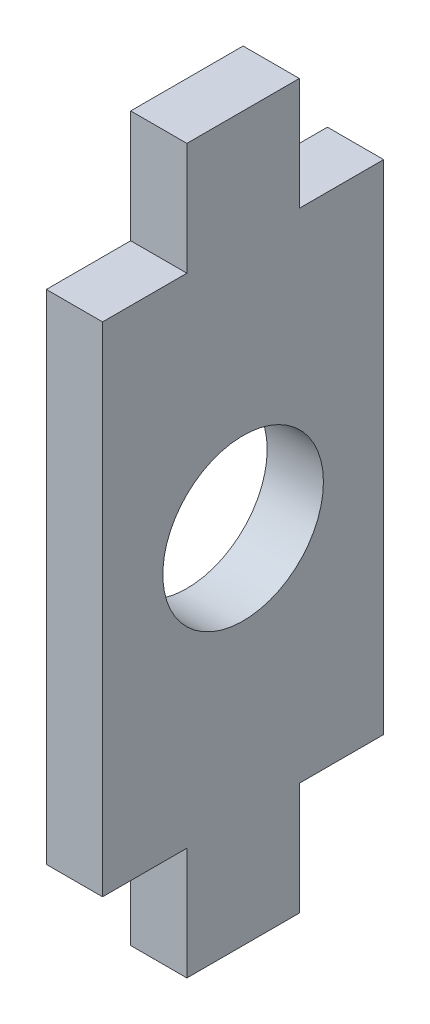
ISO-10303-21;
HEADER;
FILE_DESCRIPTION(('STEP AP214'),'2;1');
FILE_NAME('part.step','',(''),(''),'','','');
FILE_SCHEMA(('AUTOMOTIVE_DESIGN { 1 0 10303 214 1 1 1 1 }'));
ENDSEC;
DATA;
#1=APPLICATION_CONTEXT('core data for automotive mechanical design processes');
#2=APPLICATION_PROTOCOL_DEFINITION('international standard','automotive_design',2000,#1);
#3=PRODUCT_CONTEXT('',#1,'mechanical');
#4=PRODUCT('Part','Part','',(#3));
#5=PRODUCT_RELATED_PRODUCT_CATEGORY('part','',(#4));
#6=PRODUCT_DEFINITION_FORMATION('','',#4);
#7=PRODUCT_DEFINITION_CONTEXT('part definition',#1,'design');
#8=PRODUCT_DEFINITION('design','',#6,#7);
#9=PRODUCT_DEFINITION_SHAPE('','',#8);
#10=(LENGTH_UNIT() NAMED_UNIT(*) SI_UNIT(.MILLI.,.METRE.));
#11=(NAMED_UNIT(*) PLANE_ANGLE_UNIT() SI_UNIT($,.RADIAN.));
#12=(NAMED_UNIT(*) SI_UNIT($,.STERADIAN.) SOLID_ANGLE_UNIT());
#13=UNCERTAINTY_MEASURE_WITH_UNIT(LENGTH_MEASURE(1.E-05),#10,'distance_accuracy_value','');
#14=(GEOMETRIC_REPRESENTATION_CONTEXT(3) GLOBAL_UNCERTAINTY_ASSIGNED_CONTEXT((#13)) GLOBAL_UNIT_ASSIGNED_CONTEXT((#10,
#11,#12)) REPRESENTATION_CONTEXT('',''));
#15=CARTESIAN_POINT('',(0.,0.,0.));
#16=DIRECTION('',(0.,0.,1.));
#17=DIRECTION('',(1.,0.,0.));
#18=AXIS2_PLACEMENT_3D('',#15,#16,#17);
#19=CARTESIAN_POINT('',(7.,-45.,0.));
#20=DIRECTION('',(0.,1.,0.));
#21=DIRECTION('',(0.,0.,1.));
#22=AXIS2_PLACEMENT_3D('',#19,#20,#21);
#23=PLANE('',#22);
#24=DIRECTION('',(0.,0.,-1.));
#25=VECTOR('',#24,1.);
#26=CARTESIAN_POINT('',(0.,-45.,0.));
#27=LINE('',#26,#25);
#28=CARTESIAN_POINT('',(0.,-45.,6.99999999999999));
#29=VERTEX_POINT('',#28);
#30=CARTESIAN_POINT('',(0.,-45.,-7.00000000000001));
#31=VERTEX_POINT('',#30);
#32=EDGE_CURVE('E165',#29,#31,#27,.T.);
#33=ORIENTED_EDGE('',*,*,#32,.T.);
#34=DIRECTION('',(-1.,0.,0.));
#35=VECTOR('',#34,1.);
#36=CARTESIAN_POINT('',(7.,-45.,-7.00000000000001));
#37=LINE('',#36,#35);
#38=CARTESIAN_POINT('',(7.,-45.,-7.00000000000001));
#39=VERTEX_POINT('',#38);
#40=EDGE_CURVE('E11',#39,#31,#37,.T.);
#41=ORIENTED_EDGE('',*,*,#40,.F.);
#42=DIRECTION('',(0.,0.,-1.));
#43=VECTOR('',#42,1.);
#44=CARTESIAN_POINT('',(7.,-45.,0.));
#45=LINE('',#44,#43);
#46=CARTESIAN_POINT('',(7.,-45.,6.99999999999999));
#47=VERTEX_POINT('',#46);
#48=EDGE_CURVE('E197',#47,#39,#45,.T.);
#49=ORIENTED_EDGE('',*,*,#48,.F.);
#50=DIRECTION('',(-1.,0.,0.));
#51=VECTOR('',#50,1.);
#52=CARTESIAN_POINT('',(7.,-45.,6.99999999999999));
#53=LINE('',#52,#51);
#54=EDGE_CURVE('E59',#47,#29,#53,.T.);
#55=ORIENTED_EDGE('',*,*,#54,.T.);
#56=EDGE_LOOP('',(#33,#41,#49,#55));
#57=FACE_BOUND('',#56,.T.);
#58=ADVANCED_FACE('F43',(#57),#23,.F.);
#59=CARTESIAN_POINT('',(7.,0.,-7.00000000000001));
#60=DIRECTION('',(0.,0.,1.));
#61=DIRECTION('',(1.,0.,0.));
#62=AXIS2_PLACEMENT_3D('',#59,#60,#61);
#63=PLANE('',#62);
#64=DIRECTION('',(0.,1.,0.));
#65=VECTOR('',#64,1.);
#66=CARTESIAN_POINT('',(0.,0.,-7.00000000000001));
#67=LINE('',#66,#65);
#68=CARTESIAN_POINT('',(0.,-31.,-7.00000000000001));
#69=VERTEX_POINT('',#68);
#70=EDGE_CURVE('E167',#31,#69,#67,.T.);
#71=ORIENTED_EDGE('',*,*,#70,.T.);
#72=DIRECTION('',(-1.,0.,0.));
#73=VECTOR('',#72,1.);
#74=CARTESIAN_POINT('',(7.,-31.,-7.00000000000001));
#75=LINE('',#74,#73);
#76=CARTESIAN_POINT('',(7.,-31.,-7.00000000000001));
#77=VERTEX_POINT('',#76);
#78=EDGE_CURVE('E51',#77,#69,#75,.T.);
#79=ORIENTED_EDGE('',*,*,#78,.F.);
#80=DIRECTION('',(0.,1.,0.));
#81=VECTOR('',#80,1.);
#82=CARTESIAN_POINT('',(7.,0.,-7.00000000000001));
#83=LINE('',#82,#81);
#84=EDGE_CURVE('E110',#39,#77,#83,.T.);
#85=ORIENTED_EDGE('',*,*,#84,.F.);
#86=ORIENTED_EDGE('',*,*,#40,.T.);
#87=EDGE_LOOP('',(#71,#79,#85,#86));
#88=FACE_BOUND('',#87,.T.);
#89=ADVANCED_FACE('F219',(#88),#63,.F.);
#90=CARTESIAN_POINT('',(7.,-31.,0.));
#91=DIRECTION('',(0.,-1.,0.));
#92=DIRECTION('',(0.,0.,-1.));
#93=AXIS2_PLACEMENT_3D('',#90,#91,#92);
#94=PLANE('',#93);
#95=DIRECTION('',(0.,0.,1.));
#96=VECTOR('',#95,1.);
#97=CARTESIAN_POINT('',(0.,-31.,0.));
#98=LINE('',#97,#96);
#99=CARTESIAN_POINT('',(0.,-31.,-17.5));
#100=VERTEX_POINT('',#99);
#101=EDGE_CURVE('E171',#100,#69,#98,.T.);
#102=ORIENTED_EDGE('',*,*,#101,.F.);
#103=DIRECTION('',(-1.,0.,0.));
#104=VECTOR('',#103,1.);
#105=CARTESIAN_POINT('',(7.,-31.,-17.5));
#106=LINE('',#105,#104);
#107=CARTESIAN_POINT('',(7.,-31.,-17.5));
#108=VERTEX_POINT('',#107);
#109=EDGE_CURVE('E212',#108,#100,#106,.T.);
#110=ORIENTED_EDGE('',*,*,#109,.F.);
#111=DIRECTION('',(0.,0.,1.));
#112=VECTOR('',#111,1.);
#113=CARTESIAN_POINT('',(7.,-31.,0.));
#114=LINE('',#113,#112);
#115=EDGE_CURVE('E218',#108,#77,#114,.T.);
#116=ORIENTED_EDGE('',*,*,#115,.T.);
#117=ORIENTED_EDGE('',*,*,#78,.T.);
#118=EDGE_LOOP('',(#102,#110,#116,#117));
#119=FACE_BOUND('',#118,.T.);
#120=ADVANCED_FACE('F216',(#119),#94,.T.);
#121=CARTESIAN_POINT('',(7.,0.,-17.5));
#122=DIRECTION('',(0.,0.,1.));
#123=DIRECTION('',(1.,0.,0.));
#124=AXIS2_PLACEMENT_3D('',#121,#122,#123);
#125=PLANE('',#124);
#126=DIRECTION('',(0.,1.,0.));
#127=VECTOR('',#126,1.);
#128=CARTESIAN_POINT('',(0.,0.,-17.5));
#129=LINE('',#128,#127);
#130=CARTESIAN_POINT('',(0.,31.,-17.5));
#131=VERTEX_POINT('',#130);
#132=EDGE_CURVE('E174',#100,#131,#129,.T.);
#133=ORIENTED_EDGE('',*,*,#132,.T.);
#134=DIRECTION('',(-1.,0.,0.));
#135=VECTOR('',#134,1.);
#136=CARTESIAN_POINT('',(7.,31.,-17.5));
#137=LINE('',#136,#135);
#138=CARTESIAN_POINT('',(7.,31.,-17.5));
#139=VERTEX_POINT('',#138);
#140=EDGE_CURVE('E209',#139,#131,#137,.T.);
#141=ORIENTED_EDGE('',*,*,#140,.F.);
#142=DIRECTION('',(0.,1.,0.));
#143=VECTOR('',#142,1.);
#144=CARTESIAN_POINT('',(7.,0.,-17.5));
#145=LINE('',#144,#143);
#146=EDGE_CURVE('E237',#108,#139,#145,.T.);
#147=ORIENTED_EDGE('',*,*,#146,.F.);
#148=ORIENTED_EDGE('',*,*,#109,.T.);
#149=EDGE_LOOP('',(#133,#141,#147,#148));
#150=FACE_BOUND('',#149,.T.);
#151=ADVANCED_FACE('F227',(#150),#125,.F.);
#152=CARTESIAN_POINT('',(7.,31.,0.));
#153=DIRECTION('',(0.,-1.,0.));
#154=DIRECTION('',(0.,0.,-1.));
#155=AXIS2_PLACEMENT_3D('',#152,#153,#154);
#156=PLANE('',#155);
#157=DIRECTION('',(0.,0.,1.));
#158=VECTOR('',#157,1.);
#159=CARTESIAN_POINT('',(0.,31.,0.));
#160=LINE('',#159,#158);
#161=CARTESIAN_POINT('',(0.,31.,-7.00000000000001));
#162=VERTEX_POINT('',#161);
#163=EDGE_CURVE('E176',#131,#162,#160,.T.);
#164=ORIENTED_EDGE('',*,*,#163,.T.);
#165=DIRECTION('',(-1.,0.,0.));
#166=VECTOR('',#165,1.);
#167=CARTESIAN_POINT('',(7.,31.,-7.00000000000001));
#168=LINE('',#167,#166);
#169=CARTESIAN_POINT('',(7.,31.,-7.00000000000001));
#170=VERTEX_POINT('',#169);
#171=EDGE_CURVE('E207',#170,#162,#168,.T.);
#172=ORIENTED_EDGE('',*,*,#171,.F.);
#173=DIRECTION('',(0.,0.,1.));
#174=VECTOR('',#173,1.);
#175=CARTESIAN_POINT('',(7.,31.,0.));
#176=LINE('',#175,#174);
#177=EDGE_CURVE('E233',#139,#170,#176,.T.);
#178=ORIENTED_EDGE('',*,*,#177,.F.);
#179=ORIENTED_EDGE('',*,*,#140,.T.);
#180=EDGE_LOOP('',(#164,#172,#178,#179));
#181=FACE_BOUND('',#180,.T.);
#182=ADVANCED_FACE('F231',(#181),#156,.F.);
#183=CARTESIAN_POINT('',(7.,0.,-7.));
#184=DIRECTION('',(0.,0.,-1.));
#185=DIRECTION('',(0.,1.,0.));
#186=AXIS2_PLACEMENT_3D('',#183,#184,#185);
#187=PLANE('',#186);
#188=DIRECTION('',(0.,-1.,0.));
#189=VECTOR('',#188,1.);
#190=CARTESIAN_POINT('',(0.,0.,-7.));
#191=LINE('',#190,#189);
#192=CARTESIAN_POINT('',(0.,45.,-7.00000000000001));
#193=VERTEX_POINT('',#192);
#194=EDGE_CURVE('E179',#193,#162,#191,.T.);
#195=ORIENTED_EDGE('',*,*,#194,.F.);
#196=DIRECTION('',(-1.,0.,0.));
#197=VECTOR('',#196,1.);
#198=CARTESIAN_POINT('',(7.,45.,-7.00000000000001));
#199=LINE('',#198,#197);
#200=CARTESIAN_POINT('',(7.,45.,-7.00000000000001));
#201=VERTEX_POINT('',#200);
#202=EDGE_CURVE('E205',#201,#193,#199,.T.);
#203=ORIENTED_EDGE('',*,*,#202,.F.);
#204=DIRECTION('',(0.,-1.,0.));
#205=VECTOR('',#204,1.);
#206=CARTESIAN_POINT('',(7.,0.,-7.));
#207=LINE('',#206,#205);
#208=EDGE_CURVE('E236',#201,#170,#207,.T.);
#209=ORIENTED_EDGE('',*,*,#208,.T.);
#210=ORIENTED_EDGE('',*,*,#171,.T.);
#211=EDGE_LOOP('',(#195,#203,#209,#210));
#212=FACE_BOUND('',#211,.T.);
#213=ADVANCED_FACE('F325',(#212),#187,.T.);
#214=CARTESIAN_POINT('',(7.,45.,0.));
#215=DIRECTION('',(0.,1.,0.));
#216=DIRECTION('',(0.,0.,1.));
#217=AXIS2_PLACEMENT_3D('',#214,#215,#216);
#218=PLANE('',#217);
#219=DIRECTION('',(0.,0.,-1.));
#220=VECTOR('',#219,1.);
#221=CARTESIAN_POINT('',(0.,45.,0.));
#222=LINE('',#221,#220);
#223=CARTESIAN_POINT('',(0.,45.,6.99999999999999));
#224=VERTEX_POINT('',#223);
#225=EDGE_CURVE('E182',#224,#193,#222,.T.);
#226=ORIENTED_EDGE('',*,*,#225,.F.);
#227=DIRECTION('',(-1.,0.,0.));
#228=VECTOR('',#227,1.);
#229=CARTESIAN_POINT('',(7.,45.,6.99999999999999));
#230=LINE('',#229,#228);
#231=CARTESIAN_POINT('',(7.,45.,6.99999999999999));
#232=VERTEX_POINT('',#231);
#233=EDGE_CURVE('E203',#232,#224,#230,.T.);
#234=ORIENTED_EDGE('',*,*,#233,.F.);
#235=DIRECTION('',(0.,0.,-1.));
#236=VECTOR('',#235,1.);
#237=CARTESIAN_POINT('',(7.,45.,0.));
#238=LINE('',#237,#236);
#239=EDGE_CURVE('E239',#232,#201,#238,.T.);
#240=ORIENTED_EDGE('',*,*,#239,.T.);
#241=ORIENTED_EDGE('',*,*,#202,.T.);
#242=EDGE_LOOP('',(#226,#234,#240,#241));
#243=FACE_BOUND('',#242,.T.);
#244=ADVANCED_FACE('F318',(#243),#218,.T.);
#245=CARTESIAN_POINT('',(7.,0.,6.99999999999999));
#246=DIRECTION('',(0.,0.,-1.));
#247=DIRECTION('',(-1.,0.,0.));
#248=AXIS2_PLACEMENT_3D('',#245,#246,#247);
#249=PLANE('',#248);
#250=DIRECTION('',(0.,-1.,0.));
#251=VECTOR('',#250,1.);
#252=CARTESIAN_POINT('',(0.,0.,6.99999999999999));
#253=LINE('',#252,#251);
#254=CARTESIAN_POINT('',(0.,31.,6.99999999999999));
#255=VERTEX_POINT('',#254);
#256=EDGE_CURVE('E185',#224,#255,#253,.T.);
#257=ORIENTED_EDGE('',*,*,#256,.T.);
#258=DIRECTION('',(-1.,0.,0.));
#259=VECTOR('',#258,1.);
#260=CARTESIAN_POINT('',(7.,31.,6.99999999999999));
#261=LINE('',#260,#259);
#262=CARTESIAN_POINT('',(7.,31.,6.99999999999999));
#263=VERTEX_POINT('',#262);
#264=EDGE_CURVE('E201',#263,#255,#261,.T.);
#265=ORIENTED_EDGE('',*,*,#264,.F.);
#266=DIRECTION('',(0.,-1.,0.));
#267=VECTOR('',#266,1.);
#268=CARTESIAN_POINT('',(7.,0.,6.99999999999999));
#269=LINE('',#268,#267);
#270=EDGE_CURVE('E160',#232,#263,#269,.T.);
#271=ORIENTED_EDGE('',*,*,#270,.F.);
#272=ORIENTED_EDGE('',*,*,#233,.T.);
#273=EDGE_LOOP('',(#257,#265,#271,#272));
#274=FACE_BOUND('',#273,.T.);
#275=ADVANCED_FACE('F249',(#274),#249,.F.);
#276=CARTESIAN_POINT('',(7.,31.,0.));
#277=DIRECTION('',(0.,1.,0.));
#278=DIRECTION('',(0.,0.,1.));
#279=AXIS2_PLACEMENT_3D('',#276,#277,#278);
#280=PLANE('',#279);
#281=DIRECTION('',(0.,0.,-1.));
#282=VECTOR('',#281,1.);
#283=CARTESIAN_POINT('',(0.,31.,0.));
#284=LINE('',#283,#282);
#285=CARTESIAN_POINT('',(0.,31.,17.5));
#286=VERTEX_POINT('',#285);
#287=EDGE_CURVE('E188',#286,#255,#284,.T.);
#288=ORIENTED_EDGE('',*,*,#287,.F.);
#289=DIRECTION('',(-1.,0.,0.));
#290=VECTOR('',#289,1.);
#291=CARTESIAN_POINT('',(7.,31.,17.5));
#292=LINE('',#291,#290);
#293=CARTESIAN_POINT('',(7.,31.,17.5));
#294=VERTEX_POINT('',#293);
#295=EDGE_CURVE('E147',#294,#286,#292,.T.);
#296=ORIENTED_EDGE('',*,*,#295,.F.);
#297=DIRECTION('',(0.,0.,-1.));
#298=VECTOR('',#297,1.);
#299=CARTESIAN_POINT('',(7.,31.,0.));
#300=LINE('',#299,#298);
#301=EDGE_CURVE('E158',#294,#263,#300,.T.);
#302=ORIENTED_EDGE('',*,*,#301,.T.);
#303=ORIENTED_EDGE('',*,*,#264,.T.);
#304=EDGE_LOOP('',(#288,#296,#302,#303));
#305=FACE_BOUND('',#304,.T.);
#306=ADVANCED_FACE('F253',(#305),#280,.T.);
#307=CARTESIAN_POINT('',(7.,0.,17.5));
#308=DIRECTION('',(0.,0.,1.));
#309=DIRECTION('',(1.,0.,0.));
#310=AXIS2_PLACEMENT_3D('',#307,#308,#309);
#311=PLANE('',#310);
#312=DIRECTION('',(0.,1.,0.));
#313=VECTOR('',#312,1.);
#314=CARTESIAN_POINT('',(0.,0.,17.5));
#315=LINE('',#314,#313);
#316=CARTESIAN_POINT('',(0.,-31.,17.5));
#317=VERTEX_POINT('',#316);
#318=EDGE_CURVE('E144',#317,#286,#315,.T.);
#319=ORIENTED_EDGE('',*,*,#318,.F.);
#320=DIRECTION('',(-1.,0.,0.));
#321=VECTOR('',#320,1.);
#322=CARTESIAN_POINT('',(7.,-31.,17.5));
#323=LINE('',#322,#321);
#324=CARTESIAN_POINT('',(7.,-31.,17.5));
#325=VERTEX_POINT('',#324);
#326=EDGE_CURVE('E138',#325,#317,#323,.T.);
#327=ORIENTED_EDGE('',*,*,#326,.F.);
#328=DIRECTION('',(0.,1.,0.));
#329=VECTOR('',#328,1.);
#330=CARTESIAN_POINT('',(7.,0.,17.5));
#331=LINE('',#330,#329);
#332=EDGE_CURVE('E142',#325,#294,#331,.T.);
#333=ORIENTED_EDGE('',*,*,#332,.T.);
#334=ORIENTED_EDGE('',*,*,#295,.T.);
#335=EDGE_LOOP('',(#319,#327,#333,#334));
#336=FACE_BOUND('',#335,.T.);
#337=ADVANCED_FACE('F140',(#336),#311,.T.);
#338=CARTESIAN_POINT('',(7.,-31.,0.));
#339=DIRECTION('',(0.,1.,0.));
#340=DIRECTION('',(0.,0.,1.));
#341=AXIS2_PLACEMENT_3D('',#338,#339,#340);
#342=PLANE('',#341);
#343=DIRECTION('',(0.,0.,-1.));
#344=VECTOR('',#343,1.);
#345=CARTESIAN_POINT('',(0.,-31.,0.));
#346=LINE('',#345,#344);
#347=CARTESIAN_POINT('',(0.,-31.,6.99999999999999));
#348=VERTEX_POINT('',#347);
#349=EDGE_CURVE('E192',#317,#348,#346,.T.);
#350=ORIENTED_EDGE('',*,*,#349,.T.);
#351=DIRECTION('',(-1.,0.,0.));
#352=VECTOR('',#351,1.);
#353=CARTESIAN_POINT('',(7.,-31.,6.99999999999999));
#354=LINE('',#353,#352);
#355=CARTESIAN_POINT('',(7.,-31.,6.99999999999999));
#356=VERTEX_POINT('',#355);
#357=EDGE_CURVE('E98',#356,#348,#354,.T.);
#358=ORIENTED_EDGE('',*,*,#357,.F.);
#359=DIRECTION('',(0.,0.,-1.));
#360=VECTOR('',#359,1.);
#361=CARTESIAN_POINT('',(7.,-31.,0.));
#362=LINE('',#361,#360);
#363=EDGE_CURVE('E149',#325,#356,#362,.T.);
#364=ORIENTED_EDGE('',*,*,#363,.F.);
#365=ORIENTED_EDGE('',*,*,#326,.T.);
#366=EDGE_LOOP('',(#350,#358,#364,#365));
#367=FACE_BOUND('',#366,.T.);
#368=ADVANCED_FACE('F150',(#367),#342,.F.);
#369=CARTESIAN_POINT('',(7.,0.,6.99999999999999));
#370=DIRECTION('',(0.,0.,1.));
#371=DIRECTION('',(1.,0.,0.));
#372=AXIS2_PLACEMENT_3D('',#369,#370,#371);
#373=PLANE('',#372);
#374=DIRECTION('',(0.,1.,0.));
#375=VECTOR('',#374,1.);
#376=CARTESIAN_POINT('',(0.,0.,6.99999999999999));
#377=LINE('',#376,#375);
#378=EDGE_CURVE('E194',#29,#348,#377,.T.);
#379=ORIENTED_EDGE('',*,*,#378,.F.);
#380=ORIENTED_EDGE('',*,*,#54,.F.);
#381=DIRECTION('',(0.,1.,0.));
#382=VECTOR('',#381,1.);
#383=CARTESIAN_POINT('',(7.,0.,6.99999999999999));
#384=LINE('',#383,#382);
#385=EDGE_CURVE('E153',#47,#356,#384,.T.);
#386=ORIENTED_EDGE('',*,*,#385,.T.);
#387=ORIENTED_EDGE('',*,*,#357,.T.);
#388=EDGE_LOOP('',(#379,#380,#386,#387));
#389=FACE_BOUND('',#388,.T.);
#390=ADVANCED_FACE('F254',(#389),#373,.T.);
#391=CARTESIAN_POINT('',(7.,0.,0.));
#392=DIRECTION('',(1.,0.,0.));
#393=DIRECTION('',(0.,0.,-1.));
#394=AXIS2_PLACEMENT_3D('',#391,#392,#393);
#395=PLANE('',#394);
#396=CARTESIAN_POINT('',(7.,0.,0.));
#397=DIRECTION('',(1.,0.,0.));
#398=DIRECTION('',(0.,0.,-1.));
#399=AXIS2_PLACEMENT_3D('',#396,#397,#398);
#400=CIRCLE('',#399,10.);
#401=CARTESIAN_POINT('',(7.,0.,-10.));
#402=VERTEX_POINT('',#401);
#403=EDGE_CURVE('E272',#402,#402,#400,.T.);
#404=ORIENTED_EDGE('',*,*,#403,.F.);
#405=EDGE_LOOP('',(#404));
#406=FACE_BOUND('',#405,.T.);
#407=ORIENTED_EDGE('',*,*,#48,.T.);
#408=ORIENTED_EDGE('',*,*,#84,.T.);
#409=ORIENTED_EDGE('',*,*,#115,.F.);
#410=ORIENTED_EDGE('',*,*,#146,.T.);
#411=ORIENTED_EDGE('',*,*,#177,.T.);
#412=ORIENTED_EDGE('',*,*,#208,.F.);
#413=ORIENTED_EDGE('',*,*,#239,.F.);
#414=ORIENTED_EDGE('',*,*,#270,.T.);
#415=ORIENTED_EDGE('',*,*,#301,.F.);
#416=ORIENTED_EDGE('',*,*,#332,.F.);
#417=ORIENTED_EDGE('',*,*,#363,.T.);
#418=ORIENTED_EDGE('',*,*,#385,.F.);
#419=EDGE_LOOP('',(#407,#408,#409,#410,#411,#412,#413,#414,#415,#416,#417,#418));
#420=FACE_BOUND('',#419,.T.);
#421=ADVANCED_FACE('F156',(#406,#420),#395,.T.);
#422=CARTESIAN_POINT('',(0.,0.,0.));
#423=DIRECTION('',(1.,0.,0.));
#424=DIRECTION('',(0.,0.,-1.));
#425=AXIS2_PLACEMENT_3D('',#422,#423,#424);
#426=PLANE('',#425);
#427=CARTESIAN_POINT('',(0.,0.,0.));
#428=DIRECTION('',(1.,0.,0.));
#429=DIRECTION('',(0.,0.,-1.));
#430=AXIS2_PLACEMENT_3D('',#427,#428,#429);
#431=CIRCLE('',#430,10.);
#432=CARTESIAN_POINT('',(0.,0.,-10.));
#433=VERTEX_POINT('',#432);
#434=EDGE_CURVE('E168',#433,#433,#431,.T.);
#435=ORIENTED_EDGE('',*,*,#434,.T.);
#436=EDGE_LOOP('',(#435));
#437=FACE_BOUND('',#436,.T.);
#438=ORIENTED_EDGE('',*,*,#32,.F.);
#439=ORIENTED_EDGE('',*,*,#378,.T.);
#440=ORIENTED_EDGE('',*,*,#349,.F.);
#441=ORIENTED_EDGE('',*,*,#318,.T.);
#442=ORIENTED_EDGE('',*,*,#287,.T.);
#443=ORIENTED_EDGE('',*,*,#256,.F.);
#444=ORIENTED_EDGE('',*,*,#225,.T.);
#445=ORIENTED_EDGE('',*,*,#194,.T.);
#446=ORIENTED_EDGE('',*,*,#163,.F.);
#447=ORIENTED_EDGE('',*,*,#132,.F.);
#448=ORIENTED_EDGE('',*,*,#101,.T.);
#449=ORIENTED_EDGE('',*,*,#70,.F.);
#450=EDGE_LOOP('',(#438,#439,#440,#441,#442,#443,#444,#445,#446,#447,#448,#449));
#451=FACE_BOUND('',#450,.T.);
#452=ADVANCED_FACE('F223',(#437,#451),#426,.F.);
#453=CARTESIAN_POINT('',(0.,0.,0.));
#454=DIRECTION('',(1.,0.,0.));
#455=DIRECTION('',(0.,0.,-1.));
#456=AXIS2_PLACEMENT_3D('',#453,#454,#455);
#457=CYLINDRICAL_SURFACE('',#456,10.);
#458=ORIENTED_EDGE('',*,*,#434,.F.);
#459=EDGE_LOOP('',(#458));
#460=FACE_BOUND('',#459,.T.);
#461=ORIENTED_EDGE('',*,*,#403,.T.);
#462=EDGE_LOOP('',(#461));
#463=FACE_BOUND('',#462,.T.);
#464=ADVANCED_FACE('F279',(#460,#463),#457,.F.);
#465=CLOSED_SHELL('',(#58,#89,#120,#151,#182,#213,#244,#275,#306,#337,#368,#390,#421,#452,#464));
#466=MANIFOLD_SOLID_BREP('B2',#465);
#467=ADVANCED_BREP_SHAPE_REPRESENTATION('',(#18,#466),#14);
#468=SHAPE_DEFINITION_REPRESENTATION(#9,#467);
ENDSEC;
END-ISO-10303-21;
